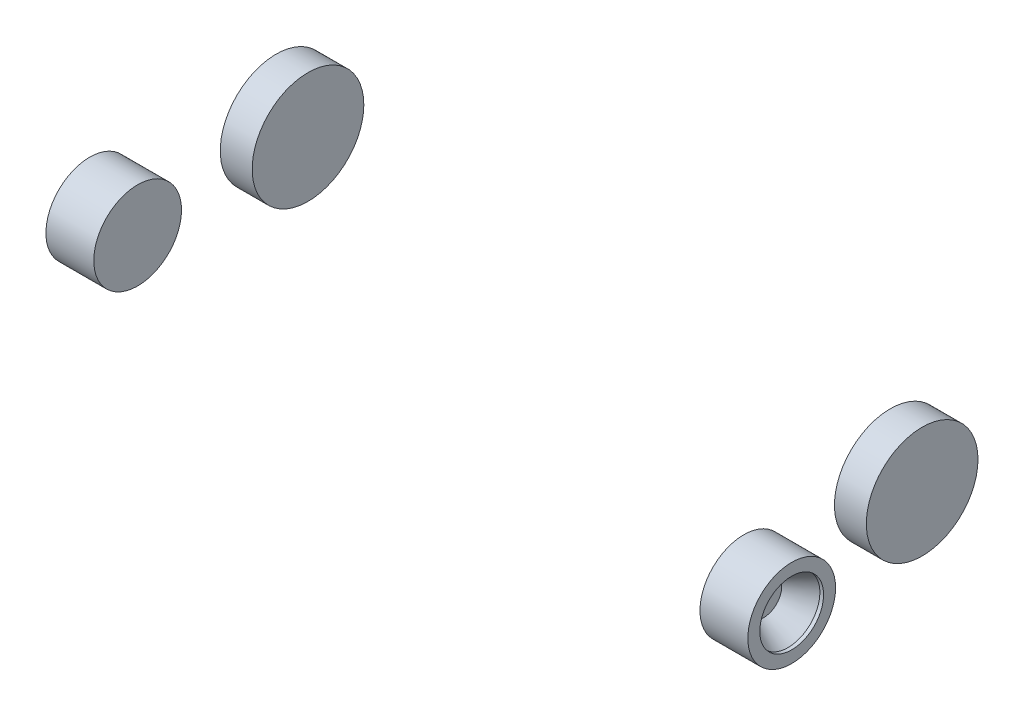
ISO-10303-21;
HEADER;
FILE_DESCRIPTION(('STEP AP214'),'2;1');
FILE_NAME('part.step','',(''),(''),'','','');
FILE_SCHEMA(('AUTOMOTIVE_DESIGN { 1 0 10303 214 1 1 1 1 }'));
ENDSEC;
DATA;
#1=APPLICATION_CONTEXT('core data for automotive mechanical design processes');
#2=APPLICATION_PROTOCOL_DEFINITION('international standard','automotive_design',2000,#1);
#3=PRODUCT_CONTEXT('',#1,'mechanical');
#4=PRODUCT('Part','Part','',(#3));
#5=PRODUCT_RELATED_PRODUCT_CATEGORY('part','',(#4));
#6=PRODUCT_DEFINITION_FORMATION('','',#4);
#7=PRODUCT_DEFINITION_CONTEXT('part definition',#1,'design');
#8=PRODUCT_DEFINITION('design','',#6,#7);
#9=PRODUCT_DEFINITION_SHAPE('','',#8);
#10=(LENGTH_UNIT() NAMED_UNIT(*) SI_UNIT(.MILLI.,.METRE.));
#11=(NAMED_UNIT(*) PLANE_ANGLE_UNIT() SI_UNIT($,.RADIAN.));
#12=(NAMED_UNIT(*) SI_UNIT($,.STERADIAN.) SOLID_ANGLE_UNIT());
#13=UNCERTAINTY_MEASURE_WITH_UNIT(LENGTH_MEASURE(1.E-05),#10,'distance_accuracy_value','');
#14=(GEOMETRIC_REPRESENTATION_CONTEXT(3) GLOBAL_UNCERTAINTY_ASSIGNED_CONTEXT((#13)) GLOBAL_UNIT_ASSIGNED_CONTEXT((#10,
#11,#12)) REPRESENTATION_CONTEXT('',''));
#15=CARTESIAN_POINT('',(0.,0.,0.));
#16=DIRECTION('',(0.,0.,1.));
#17=DIRECTION('',(1.,0.,0.));
#18=AXIS2_PLACEMENT_3D('',#15,#16,#17);
#19=CARTESIAN_POINT('',(-257.175,0.,0.));
#20=DIRECTION('',(1.,0.,0.));
#21=DIRECTION('',(0.,0.,1.));
#22=AXIS2_PLACEMENT_3D('',#19,#20,#21);
#23=CYLINDRICAL_SURFACE('',#22,44.45);
#24=CARTESIAN_POINT('',(-257.175,0.,0.));
#25=DIRECTION('',(1.,0.,0.));
#26=DIRECTION('',(0.,0.,-1.));
#27=AXIS2_PLACEMENT_3D('',#24,#25,#26);
#28=CIRCLE('',#27,44.45);
#29=CARTESIAN_POINT('',(-257.175,0.,-44.45));
#30=VERTEX_POINT('',#29);
#31=EDGE_CURVE('E11',#30,#30,#28,.T.);
#32=ORIENTED_EDGE('',*,*,#31,.T.);
#33=EDGE_LOOP('',(#32));
#34=FACE_BOUND('',#33,.T.);
#35=CARTESIAN_POINT('',(-231.775,0.,0.));
#36=DIRECTION('',(1.,0.,0.));
#37=DIRECTION('',(0.,0.,-1.));
#38=AXIS2_PLACEMENT_3D('',#35,#36,#37);
#39=CIRCLE('',#38,44.45);
#40=CARTESIAN_POINT('',(-231.775,0.,-44.45));
#41=VERTEX_POINT('',#40);
#42=EDGE_CURVE('E49',#41,#41,#39,.T.);
#43=ORIENTED_EDGE('',*,*,#42,.F.);
#44=EDGE_LOOP('',(#43));
#45=FACE_BOUND('',#44,.T.);
#46=ADVANCED_FACE('F46',(#34,#45),#23,.T.);
#47=CARTESIAN_POINT('',(-257.175,0.,0.));
#48=DIRECTION('',(-1.,0.,0.));
#49=DIRECTION('',(0.,0.,-1.));
#50=AXIS2_PLACEMENT_3D('',#47,#48,#49);
#51=PLANE('',#50);
#52=ORIENTED_EDGE('',*,*,#31,.F.);
#53=EDGE_LOOP('',(#52));
#54=FACE_BOUND('',#53,.T.);
#55=ADVANCED_FACE('F61',(#54),#51,.T.);
#56=CARTESIAN_POINT('',(-231.775,0.,0.));
#57=DIRECTION('',(-1.,0.,0.));
#58=DIRECTION('',(0.,0.,-1.));
#59=AXIS2_PLACEMENT_3D('',#56,#57,#58);
#60=PLANE('',#59);
#61=ORIENTED_EDGE('',*,*,#42,.T.);
#62=EDGE_LOOP('',(#61));
#63=FACE_BOUND('',#62,.T.);
#64=ADVANCED_FACE('F58',(#63),#60,.F.);
#65=CLOSED_SHELL('',(#46,#55,#64));
#66=MANIFOLD_SOLID_BREP('B2',#65);
#67=CARTESIAN_POINT('',(-279.4,-9.525,126.092069856608));
#68=DIRECTION('',(1.,0.,0.));
#69=DIRECTION('',(0.,0.,1.));
#70=AXIS2_PLACEMENT_3D('',#67,#68,#69);
#71=CYLINDRICAL_SURFACE('',#70,34.925);
#72=CARTESIAN_POINT('',(-279.4,-9.525,126.092069856608));
#73=DIRECTION('',(1.,0.,0.));
#74=DIRECTION('',(0.,0.,-1.));
#75=AXIS2_PLACEMENT_3D('',#72,#73,#74);
#76=CIRCLE('',#75,34.925);
#77=CARTESIAN_POINT('',(-279.4,-9.525,91.1670698566076));
#78=VERTEX_POINT('',#77);
#79=EDGE_CURVE('E45',#78,#78,#76,.T.);
#80=ORIENTED_EDGE('',*,*,#79,.T.);
#81=EDGE_LOOP('',(#80));
#82=FACE_BOUND('',#81,.T.);
#83=CARTESIAN_POINT('',(-241.3,-9.525,126.092069856608));
#84=DIRECTION('',(1.,0.,0.));
#85=DIRECTION('',(0.,0.,-1.));
#86=AXIS2_PLACEMENT_3D('',#83,#84,#85);
#87=CIRCLE('',#86,34.925);
#88=CARTESIAN_POINT('',(-241.3,-9.525,91.1670698566076));
#89=VERTEX_POINT('',#88);
#90=EDGE_CURVE('E98',#89,#89,#87,.T.);
#91=ORIENTED_EDGE('',*,*,#90,.F.);
#92=EDGE_LOOP('',(#91));
#93=FACE_BOUND('',#92,.T.);
#94=ADVANCED_FACE('F95',(#82,#93),#71,.T.);
#95=CARTESIAN_POINT('',(-279.4,-9.525,126.092069856608));
#96=DIRECTION('',(-1.,0.,0.));
#97=DIRECTION('',(0.,0.,-1.));
#98=AXIS2_PLACEMENT_3D('',#95,#96,#97);
#99=PLANE('',#98);
#100=CARTESIAN_POINT('',(-279.4,-9.525,126.092069856608));
#101=DIRECTION('',(-1.,0.,0.));
#102=DIRECTION('',(0.,0.,1.));
#103=AXIS2_PLACEMENT_3D('',#100,#101,#102);
#104=CIRCLE('',#103,25.4);
#105=CARTESIAN_POINT('',(-279.4,-9.525,151.492069856608));
#106=VERTEX_POINT('',#105);
#107=EDGE_CURVE('E112',#106,#106,#104,.T.);
#108=ORIENTED_EDGE('',*,*,#107,.F.);
#109=EDGE_LOOP('',(#108));
#110=FACE_BOUND('',#109,.T.);
#111=ORIENTED_EDGE('',*,*,#79,.F.);
#112=EDGE_LOOP('',(#111));
#113=FACE_BOUND('',#112,.T.);
#114=ADVANCED_FACE('F118',(#110,#113),#99,.T.);
#115=CARTESIAN_POINT('',(-241.3,-9.525,126.092069856608));
#116=DIRECTION('',(-1.,0.,0.));
#117=DIRECTION('',(0.,0.,-1.));
#118=AXIS2_PLACEMENT_3D('',#115,#116,#117);
#119=PLANE('',#118);
#120=ORIENTED_EDGE('',*,*,#90,.T.);
#121=EDGE_LOOP('',(#120));
#122=FACE_BOUND('',#121,.T.);
#123=ADVANCED_FACE('F121',(#122),#119,.F.);
#124=CARTESIAN_POINT('',(-257.175,-9.525,126.092069856608));
#125=DIRECTION('',(-1.,0.,0.));
#126=DIRECTION('',(0.,0.,-1.));
#127=AXIS2_PLACEMENT_3D('',#124,#125,#126);
#128=PLANE('',#127);
#129=CARTESIAN_POINT('',(-257.175,-9.525,126.092069856608));
#130=DIRECTION('',(-1.,0.,0.));
#131=DIRECTION('',(0.,0.,1.));
#132=AXIS2_PLACEMENT_3D('',#129,#130,#131);
#133=CIRCLE('',#132,14.2875);
#134=CARTESIAN_POINT('',(-257.175,-9.525,140.379569856608));
#135=VERTEX_POINT('',#134);
#136=EDGE_CURVE('E105',#135,#135,#133,.T.);
#137=ORIENTED_EDGE('',*,*,#136,.T.);
#138=EDGE_LOOP('',(#137));
#139=FACE_BOUND('',#138,.T.);
#140=ADVANCED_FACE('F127',(#139),#128,.T.);
#141=CARTESIAN_POINT('',(-276.422414599109,-9.525,126.092069856608));
#142=DIRECTION('',(-1.,0.,0.));
#143=DIRECTION('',(0.,0.,-1.));
#144=AXIS2_PLACEMENT_3D('',#141,#142,#143);
#145=CONICAL_SURFACE('',#144,25.4,0.523598775598296);
#146=ORIENTED_EDGE('',*,*,#136,.F.);
#147=EDGE_LOOP('',(#146));
#148=FACE_BOUND('',#147,.T.);
#149=CARTESIAN_POINT('',(-276.422414599109,-9.525,126.092069856608));
#150=DIRECTION('',(-1.,0.,0.));
#151=DIRECTION('',(0.,0.,1.));
#152=AXIS2_PLACEMENT_3D('',#149,#150,#151);
#153=CIRCLE('',#152,25.4);
#154=CARTESIAN_POINT('',(-276.422414599109,-9.525,151.492069856608));
#155=VERTEX_POINT('',#154);
#156=EDGE_CURVE('E109',#155,#155,#153,.T.);
#157=ORIENTED_EDGE('',*,*,#156,.T.);
#158=EDGE_LOOP('',(#157));
#159=FACE_BOUND('',#158,.T.);
#160=ADVANCED_FACE('F132',(#148,#159),#145,.F.);
#161=CARTESIAN_POINT('',(-279.4,-9.525,126.092069856608));
#162=DIRECTION('',(1.,0.,0.));
#163=DIRECTION('',(0.,0.,1.));
#164=AXIS2_PLACEMENT_3D('',#161,#162,#163);
#165=CYLINDRICAL_SURFACE('',#164,25.4);
#166=ORIENTED_EDGE('',*,*,#156,.F.);
#167=EDGE_LOOP('',(#166));
#168=FACE_BOUND('',#167,.T.);
#169=ORIENTED_EDGE('',*,*,#107,.T.);
#170=EDGE_LOOP('',(#169));
#171=FACE_BOUND('',#170,.T.);
#172=ADVANCED_FACE('F116',(#168,#171),#165,.F.);
#173=CLOSED_SHELL('',(#94,#114,#123,#140,#160,#172));
#174=MANIFOLD_SOLID_BREP('B6',#173);
#175=CARTESIAN_POINT('',(279.4,-9.525,126.092069856608));
#176=DIRECTION('',(-1.,0.,0.));
#177=DIRECTION('',(0.,0.,1.));
#178=AXIS2_PLACEMENT_3D('',#175,#176,#177);
#179=CYLINDRICAL_SURFACE('',#178,34.925);
#180=CARTESIAN_POINT('',(279.4,-9.525,126.092069856608));
#181=DIRECTION('',(1.,0.,0.));
#182=DIRECTION('',(0.,0.,-1.));
#183=AXIS2_PLACEMENT_3D('',#180,#181,#182);
#184=CIRCLE('',#183,34.925);
#185=CARTESIAN_POINT('',(279.4,-9.525,91.1670698566076));
#186=VERTEX_POINT('',#185);
#187=EDGE_CURVE('E94',#186,#186,#184,.T.);
#188=ORIENTED_EDGE('',*,*,#187,.F.);
#189=EDGE_LOOP('',(#188));
#190=FACE_BOUND('',#189,.T.);
#191=CARTESIAN_POINT('',(241.3,-9.525,126.092069856608));
#192=DIRECTION('',(1.,0.,0.));
#193=DIRECTION('',(0.,0.,-1.));
#194=AXIS2_PLACEMENT_3D('',#191,#192,#193);
#195=CIRCLE('',#194,34.925);
#196=CARTESIAN_POINT('',(241.3,-9.525,91.1670698566076));
#197=VERTEX_POINT('',#196);
#198=EDGE_CURVE('E191',#197,#197,#195,.T.);
#199=ORIENTED_EDGE('',*,*,#198,.T.);
#200=EDGE_LOOP('',(#199));
#201=FACE_BOUND('',#200,.T.);
#202=ADVANCED_FACE('F188',(#190,#201),#179,.T.);
#203=CARTESIAN_POINT('',(279.4,-9.525,126.092069856608));
#204=DIRECTION('',(1.,0.,0.));
#205=DIRECTION('',(0.,0.,-1.));
#206=AXIS2_PLACEMENT_3D('',#203,#204,#205);
#207=PLANE('',#206);
#208=CARTESIAN_POINT('',(279.4,-9.525,126.092069856608));
#209=DIRECTION('',(-1.,0.,0.));
#210=DIRECTION('',(0.,0.,1.));
#211=AXIS2_PLACEMENT_3D('',#208,#209,#210);
#212=CIRCLE('',#211,25.4);
#213=CARTESIAN_POINT('',(279.4,-9.525,151.492069856608));
#214=VERTEX_POINT('',#213);
#215=EDGE_CURVE('E205',#214,#214,#212,.T.);
#216=ORIENTED_EDGE('',*,*,#215,.T.);
#217=EDGE_LOOP('',(#216));
#218=FACE_BOUND('',#217,.T.);
#219=ORIENTED_EDGE('',*,*,#187,.T.);
#220=EDGE_LOOP('',(#219));
#221=FACE_BOUND('',#220,.T.);
#222=ADVANCED_FACE('F209',(#218,#221),#207,.T.);
#223=CARTESIAN_POINT('',(241.3,-9.525,126.092069856608));
#224=DIRECTION('',(1.,0.,0.));
#225=DIRECTION('',(0.,0.,-1.));
#226=AXIS2_PLACEMENT_3D('',#223,#224,#225);
#227=PLANE('',#226);
#228=ORIENTED_EDGE('',*,*,#198,.F.);
#229=EDGE_LOOP('',(#228));
#230=FACE_BOUND('',#229,.T.);
#231=ADVANCED_FACE('F228',(#230),#227,.F.);
#232=CARTESIAN_POINT('',(257.175,-9.525,126.092069856608));
#233=DIRECTION('',(1.,0.,0.));
#234=DIRECTION('',(0.,0.,-1.));
#235=AXIS2_PLACEMENT_3D('',#232,#233,#234);
#236=PLANE('',#235);
#237=CARTESIAN_POINT('',(257.175,-9.525,126.092069856608));
#238=DIRECTION('',(-1.,0.,0.));
#239=DIRECTION('',(0.,0.,1.));
#240=AXIS2_PLACEMENT_3D('',#237,#238,#239);
#241=CIRCLE('',#240,14.2875);
#242=CARTESIAN_POINT('',(257.175,-9.525,140.379569856608));
#243=VERTEX_POINT('',#242);
#244=EDGE_CURVE('E198',#243,#243,#241,.T.);
#245=ORIENTED_EDGE('',*,*,#244,.F.);
#246=EDGE_LOOP('',(#245));
#247=FACE_BOUND('',#246,.T.);
#248=ADVANCED_FACE('F219',(#247),#236,.T.);
#249=CARTESIAN_POINT('',(276.422414599109,-9.525,126.092069856608));
#250=DIRECTION('',(1.,0.,0.));
#251=DIRECTION('',(0.,0.,-1.));
#252=AXIS2_PLACEMENT_3D('',#249,#250,#251);
#253=CONICAL_SURFACE('',#252,25.4,0.523598775598296);
#254=ORIENTED_EDGE('',*,*,#244,.T.);
#255=EDGE_LOOP('',(#254));
#256=FACE_BOUND('',#255,.T.);
#257=CARTESIAN_POINT('',(276.422414599109,-9.525,126.092069856608));
#258=DIRECTION('',(-1.,0.,0.));
#259=DIRECTION('',(0.,0.,1.));
#260=AXIS2_PLACEMENT_3D('',#257,#258,#259);
#261=CIRCLE('',#260,25.4);
#262=CARTESIAN_POINT('',(276.422414599109,-9.525,151.492069856608));
#263=VERTEX_POINT('',#262);
#264=EDGE_CURVE('E202',#263,#263,#261,.T.);
#265=ORIENTED_EDGE('',*,*,#264,.F.);
#266=EDGE_LOOP('',(#265));
#267=FACE_BOUND('',#266,.T.);
#268=ADVANCED_FACE('F213',(#256,#267),#253,.F.);
#269=CARTESIAN_POINT('',(279.4,-9.525,126.092069856608));
#270=DIRECTION('',(-1.,0.,0.));
#271=DIRECTION('',(0.,0.,1.));
#272=AXIS2_PLACEMENT_3D('',#269,#270,#271);
#273=CYLINDRICAL_SURFACE('',#272,25.4);
#274=ORIENTED_EDGE('',*,*,#264,.T.);
#275=EDGE_LOOP('',(#274));
#276=FACE_BOUND('',#275,.T.);
#277=ORIENTED_EDGE('',*,*,#215,.F.);
#278=EDGE_LOOP('',(#277));
#279=FACE_BOUND('',#278,.T.);
#280=ADVANCED_FACE('F211',(#276,#279),#273,.F.);
#281=CLOSED_SHELL('',(#202,#222,#231,#248,#268,#280));
#282=MANIFOLD_SOLID_BREP('B40',#281);
#283=CARTESIAN_POINT('',(257.175,0.,0.));
#284=DIRECTION('',(-1.,0.,0.));
#285=DIRECTION('',(0.,0.,1.));
#286=AXIS2_PLACEMENT_3D('',#283,#284,#285);
#287=CYLINDRICAL_SURFACE('',#286,44.45);
#288=CARTESIAN_POINT('',(257.175,0.,0.));
#289=DIRECTION('',(1.,0.,0.));
#290=DIRECTION('',(0.,0.,-1.));
#291=AXIS2_PLACEMENT_3D('',#288,#289,#290);
#292=CIRCLE('',#291,44.45);
#293=CARTESIAN_POINT('',(257.175,0.,-44.45));
#294=VERTEX_POINT('',#293);
#295=EDGE_CURVE('E187',#294,#294,#292,.T.);
#296=ORIENTED_EDGE('',*,*,#295,.F.);
#297=EDGE_LOOP('',(#296));
#298=FACE_BOUND('',#297,.T.);
#299=CARTESIAN_POINT('',(231.775,0.,0.));
#300=DIRECTION('',(1.,0.,0.));
#301=DIRECTION('',(0.,0.,-1.));
#302=AXIS2_PLACEMENT_3D('',#299,#300,#301);
#303=CIRCLE('',#302,44.45);
#304=CARTESIAN_POINT('',(231.775,0.,-44.45));
#305=VERTEX_POINT('',#304);
#306=EDGE_CURVE('E277',#305,#305,#303,.T.);
#307=ORIENTED_EDGE('',*,*,#306,.T.);
#308=EDGE_LOOP('',(#307));
#309=FACE_BOUND('',#308,.T.);
#310=ADVANCED_FACE('F274',(#298,#309),#287,.T.);
#311=CARTESIAN_POINT('',(257.175,0.,0.));
#312=DIRECTION('',(1.,0.,0.));
#313=DIRECTION('',(0.,0.,-1.));
#314=AXIS2_PLACEMENT_3D('',#311,#312,#313);
#315=PLANE('',#314);
#316=ORIENTED_EDGE('',*,*,#295,.T.);
#317=EDGE_LOOP('',(#316));
#318=FACE_BOUND('',#317,.T.);
#319=ADVANCED_FACE('F289',(#318),#315,.T.);
#320=CARTESIAN_POINT('',(231.775,0.,0.));
#321=DIRECTION('',(1.,0.,0.));
#322=DIRECTION('',(0.,0.,-1.));
#323=AXIS2_PLACEMENT_3D('',#320,#321,#322);
#324=PLANE('',#323);
#325=ORIENTED_EDGE('',*,*,#306,.F.);
#326=EDGE_LOOP('',(#325));
#327=FACE_BOUND('',#326,.T.);
#328=ADVANCED_FACE('F287',(#327),#324,.F.);
#329=CLOSED_SHELL('',(#310,#319,#328));
#330=MANIFOLD_SOLID_BREP('B89',#329);
#331=ADVANCED_BREP_SHAPE_REPRESENTATION('',(#18,#66,#174,#282,#330),#14);
#332=SHAPE_DEFINITION_REPRESENTATION(#9,#331);
ENDSEC;
END-ISO-10303-21;
